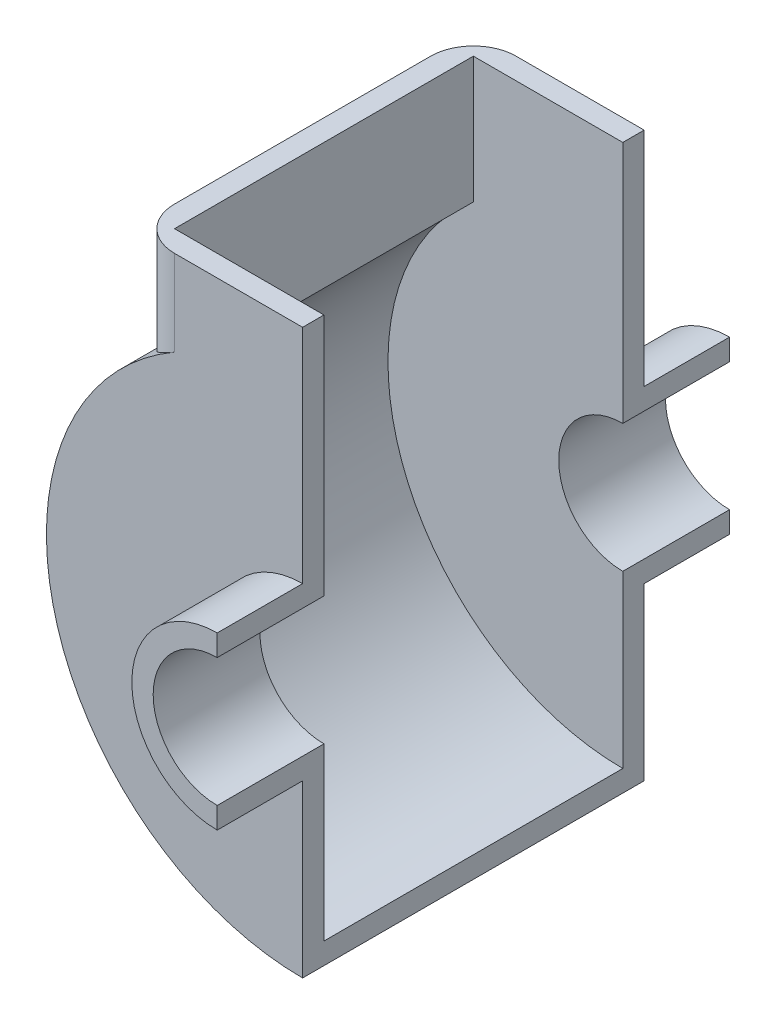
ISO-10303-21;
HEADER;
FILE_DESCRIPTION(('STEP AP214'),'2;1');
FILE_NAME('part.step','',(''),(''),'','','');
FILE_SCHEMA(('AUTOMOTIVE_DESIGN { 1 0 10303 214 1 1 1 1 }'));
ENDSEC;
DATA;
#1=APPLICATION_CONTEXT('core data for automotive mechanical design processes');
#2=APPLICATION_PROTOCOL_DEFINITION('international standard','automotive_design',2000,#1);
#3=PRODUCT_CONTEXT('',#1,'mechanical');
#4=PRODUCT('Part','Part','',(#3));
#5=PRODUCT_RELATED_PRODUCT_CATEGORY('part','',(#4));
#6=PRODUCT_DEFINITION_FORMATION('','',#4);
#7=PRODUCT_DEFINITION_CONTEXT('part definition',#1,'design');
#8=PRODUCT_DEFINITION('design','',#6,#7);
#9=PRODUCT_DEFINITION_SHAPE('','',#8);
#10=(LENGTH_UNIT() NAMED_UNIT(*) SI_UNIT(.MILLI.,.METRE.));
#11=(NAMED_UNIT(*) PLANE_ANGLE_UNIT() SI_UNIT($,.RADIAN.));
#12=(NAMED_UNIT(*) SI_UNIT($,.STERADIAN.) SOLID_ANGLE_UNIT());
#13=UNCERTAINTY_MEASURE_WITH_UNIT(LENGTH_MEASURE(1.E-05),#10,'distance_accuracy_value','');
#14=(GEOMETRIC_REPRESENTATION_CONTEXT(3) GLOBAL_UNCERTAINTY_ASSIGNED_CONTEXT((#13)) GLOBAL_UNIT_ASSIGNED_CONTEXT((#10,
#11,#12)) REPRESENTATION_CONTEXT('',''));
#15=CARTESIAN_POINT('',(0.,0.,0.));
#16=DIRECTION('',(0.,0.,1.));
#17=DIRECTION('',(1.,0.,0.));
#18=AXIS2_PLACEMENT_3D('',#15,#16,#17);
#19=CARTESIAN_POINT('',(0.,0.,25.));
#20=DIRECTION('',(0.,0.,-1.));
#21=DIRECTION('',(-1.,0.,0.));
#22=AXIS2_PLACEMENT_3D('',#19,#20,#21);
#23=CYLINDRICAL_SURFACE('',#22,15.);
#24=CARTESIAN_POINT('',(0.,0.,0.));
#25=DIRECTION('',(0.,0.,-1.));
#26=DIRECTION('',(-1.,0.,0.));
#27=AXIS2_PLACEMENT_3D('',#24,#25,#26);
#28=CIRCLE('',#27,15.);
#29=CARTESIAN_POINT('',(0.,-15.,0.));
#30=VERTEX_POINT('',#29);
#31=CARTESIAN_POINT('',(0.,15.,0.));
#32=VERTEX_POINT('',#31);
#33=EDGE_CURVE('E272',#30,#32,#28,.T.);
#34=ORIENTED_EDGE('',*,*,#33,.T.);
#35=DIRECTION('',(0.,0.,-1.));
#36=VECTOR('',#35,1.);
#37=CARTESIAN_POINT('',(0.,15.,25.));
#38=LINE('',#37,#36);
#39=CARTESIAN_POINT('',(0.,15.,25.));
#40=VERTEX_POINT('',#39);
#41=EDGE_CURVE('E296',#40,#32,#38,.T.);
#42=ORIENTED_EDGE('',*,*,#41,.F.);
#43=CARTESIAN_POINT('',(0.,0.,25.));
#44=DIRECTION('',(0.,0.,-1.));
#45=DIRECTION('',(-1.,0.,0.));
#46=AXIS2_PLACEMENT_3D('',#43,#44,#45);
#47=CIRCLE('',#46,15.);
#48=CARTESIAN_POINT('',(0.,-15.,25.));
#49=VERTEX_POINT('',#48);
#50=EDGE_CURVE('E273',#49,#40,#47,.T.);
#51=ORIENTED_EDGE('',*,*,#50,.F.);
#52=DIRECTION('',(0.,0.,-1.));
#53=VECTOR('',#52,1.);
#54=CARTESIAN_POINT('',(0.,-15.,25.));
#55=LINE('',#54,#53);
#56=EDGE_CURVE('E283',#49,#30,#55,.T.);
#57=ORIENTED_EDGE('',*,*,#56,.T.);
#58=EDGE_LOOP('',(#34,#42,#51,#57));
#59=FACE_BOUND('',#58,.T.);
#60=ADVANCED_FACE('F39',(#59),#23,.F.);
#61=CARTESIAN_POINT('',(0.,20.,25.));
#62=DIRECTION('',(-1.,0.,0.));
#63=DIRECTION('',(0.,0.,1.));
#64=AXIS2_PLACEMENT_3D('',#61,#62,#63);
#65=PLANE('',#64);
#66=DIRECTION('',(0.,1.,0.));
#67=VECTOR('',#66,1.);
#68=CARTESIAN_POINT('',(0.,20.,0.));
#69=LINE('',#68,#67);
#70=CARTESIAN_POINT('',(0.,72.,0.));
#71=VERTEX_POINT('',#70);
#72=EDGE_CURVE('E286',#32,#71,#69,.T.);
#73=ORIENTED_EDGE('',*,*,#72,.T.);
#74=DIRECTION('',(0.,0.,-1.));
#75=VECTOR('',#74,1.);
#76=CARTESIAN_POINT('',(0.,72.,5.));
#77=LINE('',#76,#75);
#78=CARTESIAN_POINT('',(0.,72.,5.));
#79=VERTEX_POINT('',#78);
#80=EDGE_CURVE('E269',#79,#71,#77,.T.);
#81=ORIENTED_EDGE('',*,*,#80,.F.);
#82=DIRECTION('',(0.,1.,0.));
#83=VECTOR('',#82,1.);
#84=CARTESIAN_POINT('',(0.,20.,5.));
#85=LINE('',#84,#83);
#86=CARTESIAN_POINT('',(0.,20.,5.));
#87=VERTEX_POINT('',#86);
#88=EDGE_CURVE('E249',#87,#79,#85,.T.);
#89=ORIENTED_EDGE('',*,*,#88,.F.);
#90=DIRECTION('',(0.,0.,-1.));
#91=VECTOR('',#90,1.);
#92=CARTESIAN_POINT('',(0.,20.,25.));
#93=LINE('',#92,#91);
#94=CARTESIAN_POINT('',(0.,20.,25.));
#95=VERTEX_POINT('',#94);
#96=EDGE_CURVE('E294',#95,#87,#93,.T.);
#97=ORIENTED_EDGE('',*,*,#96,.F.);
#98=DIRECTION('',(0.,1.,0.));
#99=VECTOR('',#98,1.);
#100=CARTESIAN_POINT('',(0.,20.,25.));
#101=LINE('',#100,#99);
#102=EDGE_CURVE('E276',#40,#95,#101,.T.);
#103=ORIENTED_EDGE('',*,*,#102,.F.);
#104=ORIENTED_EDGE('',*,*,#41,.T.);
#105=EDGE_LOOP('',(#73,#81,#89,#97,#103,#104));
#106=FACE_BOUND('',#105,.T.);
#107=ADVANCED_FACE('F325',(#106),#65,.F.);
#108=CARTESIAN_POINT('',(0.,0.,25.));
#109=DIRECTION('',(0.,0.,-1.));
#110=DIRECTION('',(-1.,0.,0.));
#111=AXIS2_PLACEMENT_3D('',#108,#109,#110);
#112=CYLINDRICAL_SURFACE('',#111,20.);
#113=ORIENTED_EDGE('',*,*,#96,.T.);
#114=CARTESIAN_POINT('',(0.,0.,5.));
#115=DIRECTION('',(0.,0.,-1.));
#116=DIRECTION('',(1.,0.,0.));
#117=AXIS2_PLACEMENT_3D('',#114,#115,#116);
#118=CIRCLE('',#117,20.);
#119=CARTESIAN_POINT('',(0.,-20.,5.));
#120=VERTEX_POINT('',#119);
#121=EDGE_CURVE('E246',#120,#87,#118,.T.);
#122=ORIENTED_EDGE('',*,*,#121,.F.);
#123=DIRECTION('',(0.,0.,-1.));
#124=VECTOR('',#123,1.);
#125=CARTESIAN_POINT('',(0.,-20.,25.));
#126=LINE('',#125,#124);
#127=CARTESIAN_POINT('',(0.,-20.,25.));
#128=VERTEX_POINT('',#127);
#129=EDGE_CURVE('E291',#128,#120,#126,.T.);
#130=ORIENTED_EDGE('',*,*,#129,.F.);
#131=CARTESIAN_POINT('',(0.,0.,25.));
#132=DIRECTION('',(0.,0.,1.));
#133=DIRECTION('',(1.,0.,0.));
#134=AXIS2_PLACEMENT_3D('',#131,#132,#133);
#135=CIRCLE('',#134,20.);
#136=EDGE_CURVE('E279',#95,#128,#135,.T.);
#137=ORIENTED_EDGE('',*,*,#136,.F.);
#138=EDGE_LOOP('',(#113,#122,#130,#137));
#139=FACE_BOUND('',#138,.T.);
#140=ADVANCED_FACE('F329',(#139),#112,.T.);
#141=CARTESIAN_POINT('',(0.,-15.,25.));
#142=DIRECTION('',(-1.,0.,0.));
#143=DIRECTION('',(0.,0.,1.));
#144=AXIS2_PLACEMENT_3D('',#141,#142,#143);
#145=PLANE('',#144);
#146=DIRECTION('',(0.,0.,-1.));
#147=VECTOR('',#146,1.);
#148=CARTESIAN_POINT('',(0.,-60.,5.));
#149=LINE('',#148,#147);
#150=CARTESIAN_POINT('',(0.,-60.,5.));
#151=VERTEX_POINT('',#150);
#152=CARTESIAN_POINT('',(0.,-60.,-75.));
#153=VERTEX_POINT('',#152);
#154=EDGE_CURVE('E259',#151,#153,#149,.T.);
#155=ORIENTED_EDGE('',*,*,#154,.T.);
#156=DIRECTION('',(0.,1.,0.));
#157=VECTOR('',#156,1.);
#158=CARTESIAN_POINT('',(0.,-60.,-75.));
#159=LINE('',#158,#157);
#160=CARTESIAN_POINT('',(0.,-20.,-75.));
#161=VERTEX_POINT('',#160);
#162=EDGE_CURVE('E185',#153,#161,#159,.T.);
#163=ORIENTED_EDGE('',*,*,#162,.T.);
#164=DIRECTION('',(0.,0.,1.));
#165=VECTOR('',#164,1.);
#166=CARTESIAN_POINT('',(0.,-20.,-95.));
#167=LINE('',#166,#165);
#168=CARTESIAN_POINT('',(0.,-20.,-95.));
#169=VERTEX_POINT('',#168);
#170=EDGE_CURVE('E217',#169,#161,#167,.T.);
#171=ORIENTED_EDGE('',*,*,#170,.F.);
#172=DIRECTION('',(0.,1.,0.));
#173=VECTOR('',#172,1.);
#174=CARTESIAN_POINT('',(0.,-15.,-95.));
#175=LINE('',#174,#173);
#176=CARTESIAN_POINT('',(0.,-15.,-95.));
#177=VERTEX_POINT('',#176);
#178=EDGE_CURVE('E207',#169,#177,#175,.T.);
#179=ORIENTED_EDGE('',*,*,#178,.T.);
#180=DIRECTION('',(0.,0.,1.));
#181=VECTOR('',#180,1.);
#182=CARTESIAN_POINT('',(0.,-15.,-95.));
#183=LINE('',#182,#181);
#184=CARTESIAN_POINT('',(0.,-15.,-70.));
#185=VERTEX_POINT('',#184);
#186=EDGE_CURVE('E209',#177,#185,#183,.T.);
#187=ORIENTED_EDGE('',*,*,#186,.T.);
#188=DIRECTION('',(0.,1.,0.));
#189=VECTOR('',#188,1.);
#190=CARTESIAN_POINT('',(0.,-15.,-70.));
#191=LINE('',#190,#189);
#192=CARTESIAN_POINT('',(0.,-55.,-70.));
#193=VERTEX_POINT('',#192);
#194=EDGE_CURVE('E202',#193,#185,#191,.T.);
#195=ORIENTED_EDGE('',*,*,#194,.F.);
#196=DIRECTION('',(0.,0.,1.));
#197=VECTOR('',#196,1.);
#198=CARTESIAN_POINT('',(0.,-55.,-95.002));
#199=LINE('',#198,#197);
#200=CARTESIAN_POINT('',(0.,-55.,0.));
#201=VERTEX_POINT('',#200);
#202=EDGE_CURVE('E230',#193,#201,#199,.T.);
#203=ORIENTED_EDGE('',*,*,#202,.T.);
#204=DIRECTION('',(0.,1.,0.));
#205=VECTOR('',#204,1.);
#206=CARTESIAN_POINT('',(0.,-15.,0.));
#207=LINE('',#206,#205);
#208=EDGE_CURVE('E277',#201,#30,#207,.T.);
#209=ORIENTED_EDGE('',*,*,#208,.T.);
#210=ORIENTED_EDGE('',*,*,#56,.F.);
#211=DIRECTION('',(0.,1.,0.));
#212=VECTOR('',#211,1.);
#213=CARTESIAN_POINT('',(0.,-15.,25.));
#214=LINE('',#213,#212);
#215=EDGE_CURVE('E281',#128,#49,#214,.T.);
#216=ORIENTED_EDGE('',*,*,#215,.F.);
#217=ORIENTED_EDGE('',*,*,#129,.T.);
#218=DIRECTION('',(0.,1.,0.));
#219=VECTOR('',#218,1.);
#220=CARTESIAN_POINT('',(0.,-60.,5.));
#221=LINE('',#220,#219);
#222=EDGE_CURVE('E256',#151,#120,#221,.T.);
#223=ORIENTED_EDGE('',*,*,#222,.F.);
#224=EDGE_LOOP('',(#155,#163,#171,#179,#187,#195,#203,#209,#210,#216,#217,#223));
#225=FACE_BOUND('',#224,.T.);
#226=ADVANCED_FACE('F333',(#225),#145,.F.);
#227=CARTESIAN_POINT('',(0.,0.,25.));
#228=DIRECTION('',(0.,0.,-1.));
#229=DIRECTION('',(-1.,0.,0.));
#230=AXIS2_PLACEMENT_3D('',#227,#228,#229);
#231=PLANE('',#230);
#232=ORIENTED_EDGE('',*,*,#50,.T.);
#233=ORIENTED_EDGE('',*,*,#102,.T.);
#234=ORIENTED_EDGE('',*,*,#136,.T.);
#235=ORIENTED_EDGE('',*,*,#215,.T.);
#236=EDGE_LOOP('',(#232,#233,#234,#235));
#237=FACE_BOUND('',#236,.T.);
#238=ADVANCED_FACE('F337',(#237),#231,.F.);
#239=CARTESIAN_POINT('',(0.,0.,0.));
#240=DIRECTION('',(0.,0.,-1.));
#241=DIRECTION('',(-1.,0.,0.));
#242=AXIS2_PLACEMENT_3D('',#239,#240,#241);
#243=PLANE('',#242);
#244=CARTESIAN_POINT('',(0.,0.,0.));
#245=DIRECTION('',(0.,0.,1.));
#246=DIRECTION('',(1.,0.,0.));
#247=AXIS2_PLACEMENT_3D('',#244,#245,#246);
#248=CIRCLE('',#247,55.);
#249=CARTESIAN_POINT('',(-35.,42.4264068711929,0.));
#250=VERTEX_POINT('',#249);
#251=EDGE_CURVE('E231',#250,#201,#248,.T.);
#252=ORIENTED_EDGE('',*,*,#251,.F.);
#253=DIRECTION('',(0.,-1.,0.));
#254=VECTOR('',#253,1.);
#255=CARTESIAN_POINT('',(-35.,72.,0.));
#256=LINE('',#255,#254);
#257=CARTESIAN_POINT('',(-35.,72.,0.));
#258=VERTEX_POINT('',#257);
#259=EDGE_CURVE('E235',#258,#250,#256,.T.);
#260=ORIENTED_EDGE('',*,*,#259,.F.);
#261=DIRECTION('',(-1.,0.,0.));
#262=VECTOR('',#261,1.);
#263=CARTESIAN_POINT('',(0.,72.,0.));
#264=LINE('',#263,#262);
#265=EDGE_CURVE('E234',#71,#258,#264,.T.);
#266=ORIENTED_EDGE('',*,*,#265,.F.);
#267=ORIENTED_EDGE('',*,*,#72,.F.);
#268=ORIENTED_EDGE('',*,*,#33,.F.);
#269=ORIENTED_EDGE('',*,*,#208,.F.);
#270=EDGE_LOOP('',(#252,#260,#266,#267,#268,#269));
#271=FACE_BOUND('',#270,.T.);
#272=ADVANCED_FACE('F339',(#271),#243,.T.);
#273=CARTESIAN_POINT('',(0.,72.,5.));
#274=DIRECTION('',(0.,-1.,0.));
#275=DIRECTION('',(0.,0.,-1.));
#276=AXIS2_PLACEMENT_3D('',#273,#274,#275);
#277=PLANE('',#276);
#278=DIRECTION('',(-1.,0.,0.));
#279=VECTOR('',#278,1.);
#280=CARTESIAN_POINT('',(0.,72.,-75.));
#281=LINE('',#280,#279);
#282=CARTESIAN_POINT('',(0.,72.,-75.));
#283=VERTEX_POINT('',#282);
#284=CARTESIAN_POINT('',(-30.,72.,-75.));
#285=VERTEX_POINT('',#284);
#286=EDGE_CURVE('E167',#283,#285,#281,.T.);
#287=ORIENTED_EDGE('',*,*,#286,.T.);
#288=CARTESIAN_POINT('',(-30.,72.,-65.));
#289=DIRECTION('',(0.,-1.,0.));
#290=DIRECTION('',(0.,0.,-1.));
#291=AXIS2_PLACEMENT_3D('',#288,#289,#290);
#292=CIRCLE('',#291,10.);
#293=CARTESIAN_POINT('',(-40.,72.,-65.));
#294=VERTEX_POINT('',#293);
#295=EDGE_CURVE('E53',#285,#294,#292,.F.);
#296=ORIENTED_EDGE('',*,*,#295,.T.);
#297=DIRECTION('',(0.,0.,-1.));
#298=VECTOR('',#297,1.);
#299=CARTESIAN_POINT('',(-40.,72.,5.));
#300=LINE('',#299,#298);
#301=CARTESIAN_POINT('',(-40.,72.,-5.));
#302=VERTEX_POINT('',#301);
#303=EDGE_CURVE('E266',#302,#294,#300,.T.);
#304=ORIENTED_EDGE('',*,*,#303,.F.);
#305=CARTESIAN_POINT('',(-30.,72.,-5.));
#306=DIRECTION('',(0.,-1.,0.));
#307=DIRECTION('',(0.,0.,-1.));
#308=AXIS2_PLACEMENT_3D('',#305,#306,#307);
#309=CIRCLE('',#308,10.);
#310=CARTESIAN_POINT('',(-30.,72.,5.));
#311=VERTEX_POINT('',#310);
#312=EDGE_CURVE('E304',#302,#311,#309,.F.);
#313=ORIENTED_EDGE('',*,*,#312,.T.);
#314=DIRECTION('',(-1.,0.,0.));
#315=VECTOR('',#314,1.);
#316=CARTESIAN_POINT('',(0.,72.,5.));
#317=LINE('',#316,#315);
#318=EDGE_CURVE('E251',#79,#311,#317,.T.);
#319=ORIENTED_EDGE('',*,*,#318,.F.);
#320=ORIENTED_EDGE('',*,*,#80,.T.);
#321=ORIENTED_EDGE('',*,*,#265,.T.);
#322=DIRECTION('',(0.,0.,1.));
#323=VECTOR('',#322,1.);
#324=CARTESIAN_POINT('',(-35.,72.,-95.002));
#325=LINE('',#324,#323);
#326=CARTESIAN_POINT('',(-35.,72.,-70.));
#327=VERTEX_POINT('',#326);
#328=EDGE_CURVE('E238',#327,#258,#325,.T.);
#329=ORIENTED_EDGE('',*,*,#328,.F.);
#330=DIRECTION('',(-1.,0.,0.));
#331=VECTOR('',#330,1.);
#332=CARTESIAN_POINT('',(0.,72.,-70.));
#333=LINE('',#332,#331);
#334=CARTESIAN_POINT('',(0.,72.,-70.));
#335=VERTEX_POINT('',#334);
#336=EDGE_CURVE('E181',#335,#327,#333,.T.);
#337=ORIENTED_EDGE('',*,*,#336,.F.);
#338=DIRECTION('',(0.,0.,1.));
#339=VECTOR('',#338,1.);
#340=CARTESIAN_POINT('',(0.,72.,-75.));
#341=LINE('',#340,#339);
#342=EDGE_CURVE('E178',#283,#335,#341,.T.);
#343=ORIENTED_EDGE('',*,*,#342,.F.);
#344=EDGE_LOOP('',(#287,#296,#304,#313,#319,#320,#321,#329,#337,#343));
#345=FACE_BOUND('',#344,.T.);
#346=ADVANCED_FACE('F179',(#345),#277,.F.);
#347=CARTESIAN_POINT('',(-40.,72.,5.));
#348=DIRECTION('',(1.,0.,0.));
#349=DIRECTION('',(0.,1.,0.));
#350=AXIS2_PLACEMENT_3D('',#347,#348,#349);
#351=PLANE('',#350);
#352=ORIENTED_EDGE('',*,*,#303,.T.);
#353=DIRECTION('',(0.,-1.,0.));
#354=VECTOR('',#353,1.);
#355=CARTESIAN_POINT('',(-40.,44.7213595499958,-65.));
#356=LINE('',#355,#354);
#357=CARTESIAN_POINT('',(-40.,44.7213595499958,-65.));
#358=VERTEX_POINT('',#357);
#359=EDGE_CURVE('E312',#294,#358,#356,.T.);
#360=ORIENTED_EDGE('',*,*,#359,.T.);
#361=DIRECTION('',(0.,0.,-1.));
#362=VECTOR('',#361,1.);
#363=CARTESIAN_POINT('',(-40.,44.7213595499958,5.));
#364=LINE('',#363,#362);
#365=CARTESIAN_POINT('',(-40.,44.7213595499958,-5.));
#366=VERTEX_POINT('',#365);
#367=EDGE_CURVE('E263',#366,#358,#364,.T.);
#368=ORIENTED_EDGE('',*,*,#367,.F.);
#369=DIRECTION('',(0.,-1.,0.));
#370=VECTOR('',#369,1.);
#371=CARTESIAN_POINT('',(-40.,72.,-5.));
#372=LINE('',#371,#370);
#373=EDGE_CURVE('E302',#366,#302,#372,.F.);
#374=ORIENTED_EDGE('',*,*,#373,.T.);
#375=EDGE_LOOP('',(#352,#360,#368,#374));
#376=FACE_BOUND('',#375,.T.);
#377=ADVANCED_FACE('F347',(#376),#351,.F.);
#378=CARTESIAN_POINT('',(0.,0.,5.));
#379=DIRECTION('',(0.,0.,-1.));
#380=DIRECTION('',(-1.,0.,0.));
#381=AXIS2_PLACEMENT_3D('',#378,#379,#380);
#382=CYLINDRICAL_SURFACE('',#381,60.);
#383=CARTESIAN_POINT('',(0.,0.,5.));
#384=DIRECTION('',(0.,0.,1.));
#385=DIRECTION('',(1.,0.,0.));
#386=AXIS2_PLACEMENT_3D('',#383,#384,#385);
#387=CIRCLE('',#386,60.);
#388=CARTESIAN_POINT('',(-30.,51.9615242270663,5.));
#389=VERTEX_POINT('',#388);
#390=EDGE_CURVE('E254',#389,#151,#387,.T.);
#391=ORIENTED_EDGE('',*,*,#390,.F.);
#392=CARTESIAN_POINT('',(-30.,51.9615242270663,5.));
#393=CARTESIAN_POINT('',(-30.1846403402756,51.8549243575684,4.99999694467445));
#394=CARTESIAN_POINT('',(-30.3686755821332,51.7473565843307,4.99488587812623));
#395=CARTESIAN_POINT('',(-30.7351668388072,51.5305231450817,4.97462918627216));
#396=CARTESIAN_POINT('',(-30.9176229894396,51.4212576273974,4.95948443281986));
#397=CARTESIAN_POINT('',(-31.4619253243051,51.0913595980358,4.89929167200636));
#398=CARTESIAN_POINT('',(-31.8209014856786,50.868512343648,4.83948477245505));
#399=CARTESIAN_POINT('',(-32.5288887310146,50.418725257113,4.6817684192746));
#400=CARTESIAN_POINT('',(-32.8778736192083,50.1917768316845,4.5837671788936));
#401=CARTESIAN_POINT('',(-33.562476910193,49.7365966241752,4.35090696893926));
#402=CARTESIAN_POINT('',(-33.8980954977704,49.5083648598862,4.21604850911225));
#403=CARTESIAN_POINT('',(-34.5207296024579,49.0759439346811,3.92574534472068));
#404=CARTESIAN_POINT('',(-34.8092512536601,48.8716304811259,3.77370267176126));
#405=CARTESIAN_POINT('',(-35.3716903107987,48.4661085573826,3.44107089228342));
#406=CARTESIAN_POINT('',(-35.6456079007732,48.2649000480893,3.26048214561176));
#407=CARTESIAN_POINT('',(-36.1765727574088,47.8682074936152,2.87135112309205));
#408=CARTESIAN_POINT('',(-36.4336405194033,47.6727166603459,2.66284378257166));
#409=CARTESIAN_POINT('',(-36.9290721152615,47.289972828363,2.21794621899144));
#410=CARTESIAN_POINT('',(-37.167441451851,47.1027174132443,1.98156425075618));
#411=CARTESIAN_POINT('',(-37.565018182153,46.785859634165,1.54478146403291));
#412=CARTESIAN_POINT('',(-37.7289458526818,46.6537017113221,1.35050833176435));
#413=CARTESIAN_POINT('',(-38.043765038696,46.397339573439,0.946710505836671));
#414=CARTESIAN_POINT('',(-38.1946575996422,46.2731347207424,0.737187037795432));
#415=CARTESIAN_POINT('',(-38.4818360085844,46.0345861261904,0.303399948510725));
#416=CARTESIAN_POINT('',(-38.618136880254,45.9202322658759,0.0791518792914228));
#417=CARTESIAN_POINT('',(-38.8746918035924,45.7032445431668,-0.383743447816978));
#418=CARTESIAN_POINT('',(-38.9949492411763,45.6006082084878,-0.622387651960075));
#419=CARTESIAN_POINT('',(-39.1965662504921,45.4273417305266,-1.06669402634216));
#420=CARTESIAN_POINT('',(-39.2809795718102,45.3543309967536,-1.27004581930022));
#421=CARTESIAN_POINT('',(-39.437114382813,45.2186323209963,-1.68488791321456));
#422=CARTESIAN_POINT('',(-39.508838494378,45.1559422467147,-1.89637652189833));
#423=CARTESIAN_POINT('',(-39.6385128100447,45.0421551914612,-2.32617263610178));
#424=CARTESIAN_POINT('',(-39.6964869139818,44.9910381018204,-2.54446755239789));
#425=CARTESIAN_POINT('',(-39.7978943535571,44.9013606141582,-2.98685266600601));
#426=CARTESIAN_POINT('',(-39.8413328734582,44.8627957393971,-3.21094076633611));
#427=CARTESIAN_POINT('',(-39.9177189665931,44.7948514731765,-3.69377442824112));
#428=CARTESIAN_POINT('',(-39.9484884415043,44.7673886419263,-3.95314914513775));
#429=CARTESIAN_POINT('',(-39.9793476433001,44.7398248250479,-4.34440444684136));
#430=CARTESIAN_POINT('',(-39.987084921451,44.7329085695169,-4.47527578752074));
#431=CARTESIAN_POINT('',(-39.9974129661721,44.7236736235071,-4.73742237599204));
#432=CARTESIAN_POINT('',(-40.0000021863485,44.7213563144782,-4.86869773328782));
#433=CARTESIAN_POINT('',(-40.,44.7213595499958,-5.));
#434=B_SPLINE_CURVE_WITH_KNOTS('',3,(#392,#393,#394,#395,#396,#397,#398,#399,#400,#401,#402,
#403,#404,#405,#406,#407,#408,#409,#410,#411,#412,#413,#414,#415,#416,#417,#418,#419,#420,#421,
#422,#423,#424,#425,#426,#427,#428,#429,#430,#431,#432,#433),.UNSPECIFIED.,.F.,.F.,(4,2,2,2,2,2,
2,2,2,2,2,2,2,2,2,2,2,2,2,2,4),(0.,0.639469988122809,1.27888441829631,2.55703672344089,
3.83827975129429,5.11950506007104,6.27274736359203,7.42597513070353,8.5777730871098,
9.72923080131075,10.5879927572485,11.4466857734357,12.3044859953459,13.1621048939207,
13.8573439066469,14.5524390989254,15.2463170957639,15.9399473495784,16.7262834977137,
17.1199731890566,17.5137811205932),.UNSPECIFIED.);
#435=EDGE_CURVE('E306',#389,#366,#434,.T.);
#436=ORIENTED_EDGE('',*,*,#435,.T.);
#437=ORIENTED_EDGE('',*,*,#367,.T.);
#438=CARTESIAN_POINT('',(-40.,44.7213595499958,-65.));
#439=CARTESIAN_POINT('',(-40.0000015812733,44.7213573011345,-65.1176634010021));
#440=CARTESIAN_POINT('',(-39.9979227141808,44.7232176305845,-65.2353086549857));
#441=CARTESIAN_POINT('',(-39.9896253110866,44.7306372942272,-65.4703286016599));
#442=CARTESIAN_POINT('',(-39.9834070494192,44.7361963832882,-65.5877033117632));
#443=CARTESIAN_POINT('',(-39.9585923280535,44.7583670958171,-65.9388427467587));
#444=CARTESIAN_POINT('',(-39.9338358355778,44.7804722797486,-66.1718758054602));
#445=CARTESIAN_POINT('',(-39.8686644525486,44.8385042167555,-66.6318691326489));
#446=CARTESIAN_POINT('',(-39.8283855148164,44.8743109465834,-66.8588643223737));
#447=CARTESIAN_POINT('',(-39.7328892662281,44.9588875680342,-67.3072524479117));
#448=CARTESIAN_POINT('',(-39.6776696039361,45.0076595001554,-67.5286444958756));
#449=CARTESIAN_POINT('',(-39.5534118644793,45.116897250534,-67.9636688649734));
#450=CARTESIAN_POINT('',(-39.4844211995899,45.1773229225701,-68.1773249178853));
#451=CARTESIAN_POINT('',(-39.3334605195833,45.3088170177995,-68.5966936542645));
#452=CARTESIAN_POINT('',(-39.2514857085459,45.3798893730022,-68.8024033675523));
#453=CARTESIAN_POINT('',(-39.0753863002098,45.5316122169458,-69.2054529377369));
#454=CARTESIAN_POINT('',(-38.9812363061758,45.6122826978885,-69.4027741200324));
#455=CARTESIAN_POINT('',(-38.7818943790383,45.7818938454653,-69.788046749896));
#456=CARTESIAN_POINT('',(-38.6767013504078,45.8708353325264,-69.9759972651116));
#457=CARTESIAN_POINT('',(-38.4135728743112,46.0916172160901,-70.4129070483267));
#458=CARTESIAN_POINT('',(-38.2509572804995,46.2267600621542,-70.6573967975821));
#459=CARTESIAN_POINT('',(-37.908447036405,46.5080507377658,-71.1270697633622));
#460=CARTESIAN_POINT('',(-37.7285517130429,46.6541989959475,-71.3522522271834));
#461=CARTESIAN_POINT('',(-37.3531054007839,46.9553345195759,-71.7833337426989));
#462=CARTESIAN_POINT('',(-37.1575367002327,47.1103317262239,-71.9892103913973));
#463=CARTESIAN_POINT('',(-36.7525951751676,47.4269223387039,-72.3811838692743));
#464=CARTESIAN_POINT('',(-36.5432234671629,47.5885152106185,-72.5672822951176));
#465=CARTESIAN_POINT('',(-35.889352420626,48.0859277319981,-73.1015951815724));
#466=CARTESIAN_POINT('',(-35.4251261289153,48.429498559668,-73.4189829871174));
#467=CARTESIAN_POINT('',(-34.4553726874119,49.1241578823887,-73.9699716496598));
#468=CARTESIAN_POINT('',(-33.9498747171002,49.4752409388269,-74.2036310842669));
#469=CARTESIAN_POINT('',(-33.1568278633415,50.0073212539565,-74.4930456878643));
#470=CARTESIAN_POINT('',(-32.8810021018505,50.1891501210001,-74.5803819665683));
#471=CARTESIAN_POINT('',(-32.3217375725054,50.5511235483305,-74.7310524671282));
#472=CARTESIAN_POINT('',(-32.0382991780871,50.7312681906542,-74.7943878640466));
#473=CARTESIAN_POINT('',(-31.4650006560554,51.0888227050653,-74.8963939978526));
#474=CARTESIAN_POINT('',(-31.1751356203563,51.2662302982853,-74.9350451611661));
#475=CARTESIAN_POINT('',(-30.5906934832528,51.6171131325133,-74.9868485137105));
#476=CARTESIAN_POINT('',(-30.2961152167169,51.7905873747387,-74.9999942965489));
#477=CARTESIAN_POINT('',(-30.,51.9615242270663,-75.));
#478=B_SPLINE_CURVE_WITH_KNOTS('',3,(#438,#439,#440,#441,#442,#443,#444,#445,#446,#447,#448,
#449,#450,#451,#452,#453,#454,#455,#456,#457,#458,#459,#460,#461,#462,#463,#464,#465,#466,#467,
#468,#469,#470,#471,#472,#473,#474,#475,#476,#477),.UNSPECIFIED.,.F.,.F.,(4,2,2,2,2,2,2,2,2,2,2,
2,2,2,2,2,2,2,2,4),(0.,0.352921378883185,0.705819370583172,1.41085932128629,2.10985961734753,
2.80896998914977,3.50571366437716,4.20271529673452,4.90119502233958,5.59974410640154,
6.5680578816333,7.53640938987799,8.50587104319846,9.47525437387455,11.4447404103531,
13.4128458625583,14.4372042618812,15.4615125030147,16.4866319729198,17.5120088970542),.UNSPECIFIED.);
#479=CARTESIAN_POINT('',(-30.,51.9615242270663,-75.));
#480=VERTEX_POINT('',#479);
#481=EDGE_CURVE('E11',#358,#480,#478,.T.);
#482=ORIENTED_EDGE('',*,*,#481,.T.);
#483=CARTESIAN_POINT('',(0.,0.,-75.));
#484=DIRECTION('',(0.,0.,1.));
#485=DIRECTION('',(1.,0.,0.));
#486=AXIS2_PLACEMENT_3D('',#483,#484,#485);
#487=CIRCLE('',#486,60.);
#488=EDGE_CURVE('E60',#480,#153,#487,.T.);
#489=ORIENTED_EDGE('',*,*,#488,.T.);
#490=ORIENTED_EDGE('',*,*,#154,.F.);
#491=EDGE_LOOP('',(#391,#436,#437,#482,#489,#490));
#492=FACE_BOUND('',#491,.T.);
#493=ADVANCED_FACE('F314',(#492),#382,.T.);
#494=CARTESIAN_POINT('',(0.,0.,5.));
#495=DIRECTION('',(0.,0.,1.));
#496=DIRECTION('',(1.,0.,0.));
#497=AXIS2_PLACEMENT_3D('',#494,#495,#496);
#498=PLANE('',#497);
#499=ORIENTED_EDGE('',*,*,#318,.T.);
#500=DIRECTION('',(0.,-1.,0.));
#501=VECTOR('',#500,1.);
#502=CARTESIAN_POINT('',(-30.,44.7213595499958,5.));
#503=LINE('',#502,#501);
#504=EDGE_CURVE('E299',#311,#389,#503,.T.);
#505=ORIENTED_EDGE('',*,*,#504,.T.);
#506=ORIENTED_EDGE('',*,*,#390,.T.);
#507=ORIENTED_EDGE('',*,*,#222,.T.);
#508=ORIENTED_EDGE('',*,*,#121,.T.);
#509=ORIENTED_EDGE('',*,*,#88,.T.);
#510=EDGE_LOOP('',(#499,#505,#506,#507,#508,#509));
#511=FACE_BOUND('',#510,.T.);
#512=ADVANCED_FACE('F353',(#511),#498,.T.);
#513=CARTESIAN_POINT('',(0.,0.,-95.002));
#514=DIRECTION('',(0.,0.,1.));
#515=DIRECTION('',(1.,0.,0.));
#516=AXIS2_PLACEMENT_3D('',#513,#514,#515);
#517=CYLINDRICAL_SURFACE('',#516,55.);
#518=ORIENTED_EDGE('',*,*,#202,.F.);
#519=CARTESIAN_POINT('',(0.,0.,-70.));
#520=DIRECTION('',(0.,0.,1.));
#521=DIRECTION('',(1.,0.,0.));
#522=AXIS2_PLACEMENT_3D('',#519,#520,#521);
#523=CIRCLE('',#522,55.);
#524=CARTESIAN_POINT('',(-35.,42.4264068711929,-70.));
#525=VERTEX_POINT('',#524);
#526=EDGE_CURVE('E224',#193,#525,#523,.F.);
#527=ORIENTED_EDGE('',*,*,#526,.T.);
#528=DIRECTION('',(0.,0.,1.));
#529=VECTOR('',#528,1.);
#530=CARTESIAN_POINT('',(-35.,42.4264068711929,-95.002));
#531=LINE('',#530,#529);
#532=EDGE_CURVE('E241',#525,#250,#531,.T.);
#533=ORIENTED_EDGE('',*,*,#532,.T.);
#534=ORIENTED_EDGE('',*,*,#251,.T.);
#535=EDGE_LOOP('',(#518,#527,#533,#534));
#536=FACE_BOUND('',#535,.T.);
#537=ADVANCED_FACE('F380',(#536),#517,.F.);
#538=CARTESIAN_POINT('',(-35.,72.,-95.002));
#539=DIRECTION('',(-1.,0.,0.));
#540=DIRECTION('',(0.,-1.,0.));
#541=AXIS2_PLACEMENT_3D('',#538,#539,#540);
#542=PLANE('',#541);
#543=ORIENTED_EDGE('',*,*,#532,.F.);
#544=DIRECTION('',(0.,1.,0.));
#545=VECTOR('',#544,1.);
#546=CARTESIAN_POINT('',(-35.,72.,-70.));
#547=LINE('',#546,#545);
#548=EDGE_CURVE('E227',#525,#327,#547,.T.);
#549=ORIENTED_EDGE('',*,*,#548,.T.);
#550=ORIENTED_EDGE('',*,*,#328,.T.);
#551=ORIENTED_EDGE('',*,*,#259,.T.);
#552=EDGE_LOOP('',(#543,#549,#550,#551));
#553=FACE_BOUND('',#552,.T.);
#554=ADVANCED_FACE('F374',(#553),#542,.F.);
#555=CARTESIAN_POINT('',(0.,0.,-70.));
#556=DIRECTION('',(0.,0.,1.));
#557=DIRECTION('',(-1.,0.,0.));
#558=AXIS2_PLACEMENT_3D('',#555,#556,#557);
#559=PLANE('',#558);
#560=ORIENTED_EDGE('',*,*,#548,.F.);
#561=ORIENTED_EDGE('',*,*,#526,.F.);
#562=ORIENTED_EDGE('',*,*,#194,.T.);
#563=CARTESIAN_POINT('',(0.,0.,-70.));
#564=DIRECTION('',(0.,0.,-1.));
#565=DIRECTION('',(-1.,0.,0.));
#566=AXIS2_PLACEMENT_3D('',#563,#564,#565);
#567=CIRCLE('',#566,15.);
#568=CARTESIAN_POINT('',(0.,15.,-70.));
#569=VERTEX_POINT('',#568);
#570=EDGE_CURVE('E184',#185,#569,#567,.T.);
#571=ORIENTED_EDGE('',*,*,#570,.T.);
#572=DIRECTION('',(0.,1.,0.));
#573=VECTOR('',#572,1.);
#574=CARTESIAN_POINT('',(0.,20.,-70.));
#575=LINE('',#574,#573);
#576=EDGE_CURVE('E212',#569,#335,#575,.T.);
#577=ORIENTED_EDGE('',*,*,#576,.T.);
#578=ORIENTED_EDGE('',*,*,#336,.T.);
#579=EDGE_LOOP('',(#560,#561,#562,#571,#577,#578));
#580=FACE_BOUND('',#579,.T.);
#581=ADVANCED_FACE('F376',(#580),#559,.T.);
#582=CARTESIAN_POINT('',(0.,0.,-95.));
#583=DIRECTION('',(0.,0.,1.));
#584=DIRECTION('',(-1.,0.,0.));
#585=AXIS2_PLACEMENT_3D('',#582,#583,#584);
#586=CYLINDRICAL_SURFACE('',#585,15.);
#587=ORIENTED_EDGE('',*,*,#570,.F.);
#588=ORIENTED_EDGE('',*,*,#186,.F.);
#589=CARTESIAN_POINT('',(0.,0.,-95.));
#590=DIRECTION('',(0.,0.,-1.));
#591=DIRECTION('',(-1.,0.,0.));
#592=AXIS2_PLACEMENT_3D('',#589,#590,#591);
#593=CIRCLE('',#592,15.);
#594=CARTESIAN_POINT('',(0.,15.,-95.));
#595=VERTEX_POINT('',#594);
#596=EDGE_CURVE('E198',#177,#595,#593,.T.);
#597=ORIENTED_EDGE('',*,*,#596,.T.);
#598=DIRECTION('',(0.,0.,1.));
#599=VECTOR('',#598,1.);
#600=CARTESIAN_POINT('',(0.,15.,-95.));
#601=LINE('',#600,#599);
#602=EDGE_CURVE('E221',#595,#569,#601,.T.);
#603=ORIENTED_EDGE('',*,*,#602,.T.);
#604=EDGE_LOOP('',(#587,#588,#597,#603));
#605=FACE_BOUND('',#604,.T.);
#606=ADVANCED_FACE('F385',(#605),#586,.F.);
#607=CARTESIAN_POINT('',(0.,20.,-95.));
#608=DIRECTION('',(-1.,0.,0.));
#609=DIRECTION('',(0.,0.,-1.));
#610=AXIS2_PLACEMENT_3D('',#607,#608,#609);
#611=PLANE('',#610);
#612=ORIENTED_EDGE('',*,*,#576,.F.);
#613=ORIENTED_EDGE('',*,*,#602,.F.);
#614=DIRECTION('',(0.,1.,0.));
#615=VECTOR('',#614,1.);
#616=CARTESIAN_POINT('',(0.,20.,-95.));
#617=LINE('',#616,#615);
#618=CARTESIAN_POINT('',(0.,20.,-95.));
#619=VERTEX_POINT('',#618);
#620=EDGE_CURVE('E201',#595,#619,#617,.T.);
#621=ORIENTED_EDGE('',*,*,#620,.T.);
#622=DIRECTION('',(0.,0.,1.));
#623=VECTOR('',#622,1.);
#624=CARTESIAN_POINT('',(0.,20.,-95.));
#625=LINE('',#624,#623);
#626=CARTESIAN_POINT('',(0.,20.,-75.));
#627=VERTEX_POINT('',#626);
#628=EDGE_CURVE('E190',#619,#627,#625,.T.);
#629=ORIENTED_EDGE('',*,*,#628,.T.);
#630=DIRECTION('',(0.,1.,0.));
#631=VECTOR('',#630,1.);
#632=CARTESIAN_POINT('',(0.,20.,-75.));
#633=LINE('',#632,#631);
#634=EDGE_CURVE('E172',#627,#283,#633,.T.);
#635=ORIENTED_EDGE('',*,*,#634,.T.);
#636=ORIENTED_EDGE('',*,*,#342,.T.);
#637=EDGE_LOOP('',(#612,#613,#621,#629,#635,#636));
#638=FACE_BOUND('',#637,.T.);
#639=ADVANCED_FACE('F187',(#638),#611,.F.);
#640=CARTESIAN_POINT('',(0.,0.,-95.));
#641=DIRECTION('',(0.,0.,1.));
#642=DIRECTION('',(-1.,0.,0.));
#643=AXIS2_PLACEMENT_3D('',#640,#641,#642);
#644=CYLINDRICAL_SURFACE('',#643,20.);
#645=ORIENTED_EDGE('',*,*,#628,.F.);
#646=CARTESIAN_POINT('',(0.,0.,-95.));
#647=DIRECTION('',(0.,0.,1.));
#648=DIRECTION('',(1.,0.,0.));
#649=AXIS2_PLACEMENT_3D('',#646,#647,#648);
#650=CIRCLE('',#649,20.);
#651=EDGE_CURVE('E204',#619,#169,#650,.T.);
#652=ORIENTED_EDGE('',*,*,#651,.T.);
#653=ORIENTED_EDGE('',*,*,#170,.T.);
#654=CARTESIAN_POINT('',(0.,0.,-75.));
#655=DIRECTION('',(0.,0.,-1.));
#656=DIRECTION('',(1.,0.,0.));
#657=AXIS2_PLACEMENT_3D('',#654,#655,#656);
#658=CIRCLE('',#657,20.);
#659=EDGE_CURVE('E191',#161,#627,#658,.T.);
#660=ORIENTED_EDGE('',*,*,#659,.T.);
#661=EDGE_LOOP('',(#645,#652,#653,#660));
#662=FACE_BOUND('',#661,.T.);
#663=ADVANCED_FACE('F392',(#662),#644,.T.);
#664=CARTESIAN_POINT('',(0.,0.,-95.));
#665=DIRECTION('',(0.,0.,1.));
#666=DIRECTION('',(-1.,0.,0.));
#667=AXIS2_PLACEMENT_3D('',#664,#665,#666);
#668=PLANE('',#667);
#669=ORIENTED_EDGE('',*,*,#596,.F.);
#670=ORIENTED_EDGE('',*,*,#178,.F.);
#671=ORIENTED_EDGE('',*,*,#651,.F.);
#672=ORIENTED_EDGE('',*,*,#620,.F.);
#673=EDGE_LOOP('',(#669,#670,#671,#672));
#674=FACE_BOUND('',#673,.T.);
#675=ADVANCED_FACE('F389',(#674),#668,.F.);
#676=CARTESIAN_POINT('',(0.,0.,-75.));
#677=DIRECTION('',(0.,0.,-1.));
#678=DIRECTION('',(1.,0.,0.));
#679=AXIS2_PLACEMENT_3D('',#676,#677,#678);
#680=PLANE('',#679);
#681=ORIENTED_EDGE('',*,*,#488,.F.);
#682=DIRECTION('',(0.,-1.,0.));
#683=VECTOR('',#682,1.);
#684=CARTESIAN_POINT('',(-30.,72.,-75.));
#685=LINE('',#684,#683);
#686=EDGE_CURVE('E64',#480,#285,#685,.F.);
#687=ORIENTED_EDGE('',*,*,#686,.T.);
#688=ORIENTED_EDGE('',*,*,#286,.F.);
#689=ORIENTED_EDGE('',*,*,#634,.F.);
#690=ORIENTED_EDGE('',*,*,#659,.F.);
#691=ORIENTED_EDGE('',*,*,#162,.F.);
#692=EDGE_LOOP('',(#681,#687,#688,#689,#690,#691));
#693=FACE_BOUND('',#692,.T.);
#694=ADVANCED_FACE('F169',(#693),#680,.T.);
#695=CARTESIAN_POINT('',(-30.,0.,-5.));
#696=DIRECTION('',(0.,1.,0.));
#697=DIRECTION('',(-1.,0.,0.));
#698=AXIS2_PLACEMENT_3D('',#695,#696,#697);
#699=CYLINDRICAL_SURFACE('',#698,10.);
#700=ORIENTED_EDGE('',*,*,#312,.F.);
#701=ORIENTED_EDGE('',*,*,#373,.F.);
#702=ORIENTED_EDGE('',*,*,#435,.F.);
#703=ORIENTED_EDGE('',*,*,#504,.F.);
#704=EDGE_LOOP('',(#700,#701,#702,#703));
#705=FACE_BOUND('',#704,.T.);
#706=ADVANCED_FACE('F318',(#705),#699,.T.);
#707=CARTESIAN_POINT('',(-30.,72.,-65.));
#708=DIRECTION('',(0.,1.,0.));
#709=DIRECTION('',(-1.,0.,0.));
#710=AXIS2_PLACEMENT_3D('',#707,#708,#709);
#711=CYLINDRICAL_SURFACE('',#710,10.);
#712=ORIENTED_EDGE('',*,*,#295,.F.);
#713=ORIENTED_EDGE('',*,*,#686,.F.);
#714=ORIENTED_EDGE('',*,*,#481,.F.);
#715=ORIENTED_EDGE('',*,*,#359,.F.);
#716=EDGE_LOOP('',(#712,#713,#714,#715));
#717=FACE_BOUND('',#716,.T.);
#718=ADVANCED_FACE('F41',(#717),#711,.T.);
#719=CLOSED_SHELL('',(#60,#107,#140,#226,#238,#272,#346,#377,#493,#512,#537,#554,#581,#606,#639,
#663,#675,#694,#706,#718));
#720=MANIFOLD_SOLID_BREP('B2',#719);
#721=ADVANCED_BREP_SHAPE_REPRESENTATION('',(#18,#720),#14);
#722=SHAPE_DEFINITION_REPRESENTATION(#9,#721);
ENDSEC;
END-ISO-10303-21;
